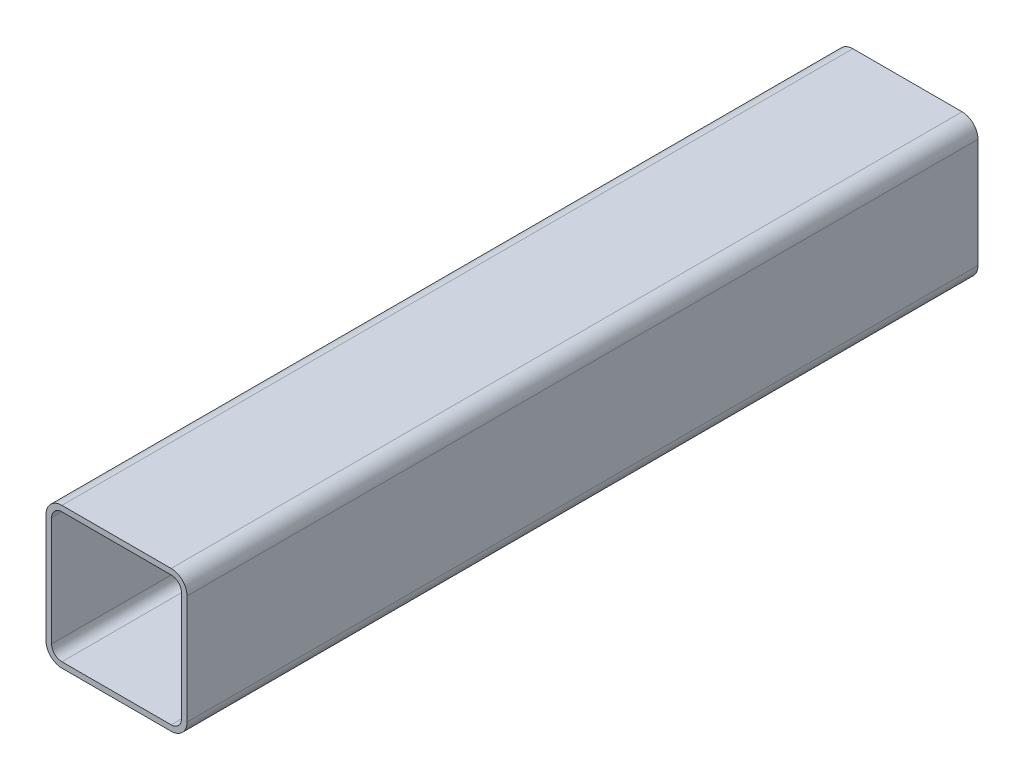
ISO-10303-21;
HEADER;
FILE_DESCRIPTION(('STEP AP214'),'2;1');
FILE_NAME('part.step','',(''),(''),'','','');
FILE_SCHEMA(('AUTOMOTIVE_DESIGN { 1 0 10303 214 1 1 1 1 }'));
ENDSEC;
DATA;
#1=APPLICATION_CONTEXT('core data for automotive mechanical design processes');
#2=APPLICATION_PROTOCOL_DEFINITION('international standard','automotive_design',2000,#1);
#3=PRODUCT_CONTEXT('',#1,'mechanical');
#4=PRODUCT('Part','Part','',(#3));
#5=PRODUCT_RELATED_PRODUCT_CATEGORY('part','',(#4));
#6=PRODUCT_DEFINITION_FORMATION('','',#4);
#7=PRODUCT_DEFINITION_CONTEXT('part definition',#1,'design');
#8=PRODUCT_DEFINITION('design','',#6,#7);
#9=PRODUCT_DEFINITION_SHAPE('','',#8);
#10=(LENGTH_UNIT() NAMED_UNIT(*) SI_UNIT(.MILLI.,.METRE.));
#11=(NAMED_UNIT(*) PLANE_ANGLE_UNIT() SI_UNIT($,.RADIAN.));
#12=(NAMED_UNIT(*) SI_UNIT($,.STERADIAN.) SOLID_ANGLE_UNIT());
#13=UNCERTAINTY_MEASURE_WITH_UNIT(LENGTH_MEASURE(1.E-05),#10,'distance_accuracy_value','');
#14=(GEOMETRIC_REPRESENTATION_CONTEXT(3) GLOBAL_UNCERTAINTY_ASSIGNED_CONTEXT((#13)) GLOBAL_UNIT_ASSIGNED_CONTEXT((#10,
#11,#12)) REPRESENTATION_CONTEXT('',''));
#15=CARTESIAN_POINT('',(0.,0.,0.));
#16=DIRECTION('',(0.,0.,1.));
#17=DIRECTION('',(1.,0.,0.));
#18=AXIS2_PLACEMENT_3D('',#15,#16,#17);
#19=CARTESIAN_POINT('',(-27.178,-27.178,-152.4));
#20=DIRECTION('',(0.,0.,1.));
#21=DIRECTION('',(1.,0.,0.));
#22=AXIS2_PLACEMENT_3D('',#19,#20,#21);
#23=PLANE('',#22);
#24=DIRECTION('',(0.,1.,0.));
#25=VECTOR('',#24,1.);
#26=CARTESIAN_POINT('',(-25.019,0.,-152.4));
#27=LINE('',#26,#25);
#28=CARTESIAN_POINT('',(-25.019,-21.0502500003569,-152.4));
#29=VERTEX_POINT('',#28);
#30=CARTESIAN_POINT('',(-25.019,21.0502499999995,-152.4));
#31=VERTEX_POINT('',#30);
#32=EDGE_CURVE('E157',#29,#31,#27,.T.);
#33=ORIENTED_EDGE('',*,*,#32,.F.);
#34=CARTESIAN_POINT('',(-21.05025,-21.0502500000011,-152.4));
#35=DIRECTION('',(0.,0.,-1.));
#36=DIRECTION('',(0.,1.,0.));
#37=AXIS2_PLACEMENT_3D('',#34,#35,#36);
#38=CIRCLE('',#37,3.96875);
#39=CARTESIAN_POINT('',(-21.0502499992366,-25.019,-152.4));
#40=VERTEX_POINT('',#39);
#41=EDGE_CURVE('E208',#40,#29,#38,.T.);
#42=ORIENTED_EDGE('',*,*,#41,.F.);
#43=DIRECTION('',(-1.,0.,0.));
#44=VECTOR('',#43,1.);
#45=CARTESIAN_POINT('',(0.,-25.019,-152.4));
#46=LINE('',#45,#44);
#47=CARTESIAN_POINT('',(21.05025,-25.019,-152.4));
#48=VERTEX_POINT('',#47);
#49=EDGE_CURVE('E153',#48,#40,#46,.T.);
#50=ORIENTED_EDGE('',*,*,#49,.F.);
#51=CARTESIAN_POINT('',(21.05025,-21.0502500000011,-152.4));
#52=DIRECTION('',(0.,0.,-1.));
#53=DIRECTION('',(0.,1.,0.));
#54=AXIS2_PLACEMENT_3D('',#51,#52,#53);
#55=CIRCLE('',#54,3.96875);
#56=CARTESIAN_POINT('',(25.019,-21.0502500008145,-152.4));
#57=VERTEX_POINT('',#56);
#58=EDGE_CURVE('E212',#57,#48,#55,.T.);
#59=ORIENTED_EDGE('',*,*,#58,.F.);
#60=DIRECTION('',(0.,-1.,0.));
#61=VECTOR('',#60,1.);
#62=CARTESIAN_POINT('',(25.019,0.,-152.4));
#63=LINE('',#62,#61);
#64=CARTESIAN_POINT('',(25.019,21.0502499999995,-152.4));
#65=VERTEX_POINT('',#64);
#66=EDGE_CURVE('E162',#65,#57,#63,.T.);
#67=ORIENTED_EDGE('',*,*,#66,.F.);
#68=CARTESIAN_POINT('',(21.05025,21.0502499999989,-152.4));
#69=DIRECTION('',(0.,0.,-1.));
#70=DIRECTION('',(0.,1.,0.));
#71=AXIS2_PLACEMENT_3D('',#68,#69,#70);
#72=CIRCLE('',#71,3.96875);
#73=CARTESIAN_POINT('',(21.050250000407,25.019,-152.4));
#74=VERTEX_POINT('',#73);
#75=EDGE_CURVE('E215',#74,#65,#72,.T.);
#76=ORIENTED_EDGE('',*,*,#75,.F.);
#77=DIRECTION('',(1.,0.,0.));
#78=VECTOR('',#77,1.);
#79=CARTESIAN_POINT('',(0.,25.019,-152.4));
#80=LINE('',#79,#78);
#81=CARTESIAN_POINT('',(-21.05025,25.019,-152.4));
#82=VERTEX_POINT('',#81);
#83=EDGE_CURVE('E167',#82,#74,#80,.T.);
#84=ORIENTED_EDGE('',*,*,#83,.F.);
#85=CARTESIAN_POINT('',(-21.05025,21.0502499999989,-152.4));
#86=DIRECTION('',(0.,0.,-1.));
#87=DIRECTION('',(0.,1.,0.));
#88=AXIS2_PLACEMENT_3D('',#85,#86,#87);
#89=CIRCLE('',#88,3.96875);
#90=EDGE_CURVE('E160',#31,#82,#89,.T.);
#91=ORIENTED_EDGE('',*,*,#90,.F.);
#92=EDGE_LOOP('',(#33,#42,#50,#59,#67,#76,#84,#91));
#93=FACE_BOUND('',#92,.T.);
#94=DIRECTION('',(0.,-1.,0.));
#95=VECTOR('',#94,1.);
#96=CARTESIAN_POINT('',(27.178,0.,-152.4));
#97=LINE('',#96,#95);
#98=CARTESIAN_POINT('',(27.178,21.0502499999997,-152.4));
#99=VERTEX_POINT('',#98);
#100=CARTESIAN_POINT('',(27.178,-21.0502500000003,-152.4));
#101=VERTEX_POINT('',#100);
#102=EDGE_CURVE('E161',#99,#101,#97,.T.);
#103=ORIENTED_EDGE('',*,*,#102,.T.);
#104=CARTESIAN_POINT('',(21.05025,-21.0502500000007,-152.4));
#105=DIRECTION('',(0.,0.,-1.));
#106=DIRECTION('',(0.,1.,0.));
#107=AXIS2_PLACEMENT_3D('',#104,#105,#106);
#108=CIRCLE('',#107,6.12775);
#109=CARTESIAN_POINT('',(21.0502500011786,-27.178,-152.4));
#110=VERTEX_POINT('',#109);
#111=EDGE_CURVE('E220',#101,#110,#108,.T.);
#112=ORIENTED_EDGE('',*,*,#111,.T.);
#113=DIRECTION('',(-1.,0.,0.));
#114=VECTOR('',#113,1.);
#115=CARTESIAN_POINT('',(0.,-27.178,-152.4));
#116=LINE('',#115,#114);
#117=CARTESIAN_POINT('',(-21.05025,-27.178,-152.4));
#118=VERTEX_POINT('',#117);
#119=EDGE_CURVE('E173',#110,#118,#116,.T.);
#120=ORIENTED_EDGE('',*,*,#119,.T.);
#121=CARTESIAN_POINT('',(-21.05025,-21.0502500000007,-152.4));
#122=DIRECTION('',(0.,0.,-1.));
#123=DIRECTION('',(0.,1.,0.));
#124=AXIS2_PLACEMENT_3D('',#121,#122,#123);
#125=CIRCLE('',#124,6.12775);
#126=CARTESIAN_POINT('',(-27.178,-21.0502500005506,-152.4));
#127=VERTEX_POINT('',#126);
#128=EDGE_CURVE('E224',#118,#127,#125,.T.);
#129=ORIENTED_EDGE('',*,*,#128,.T.);
#130=DIRECTION('',(0.,1.,0.));
#131=VECTOR('',#130,1.);
#132=CARTESIAN_POINT('',(-27.178,0.,-152.4));
#133=LINE('',#132,#131);
#134=CARTESIAN_POINT('',(-27.178,21.0502499999997,-152.4));
#135=VERTEX_POINT('',#134);
#136=EDGE_CURVE('E178',#127,#135,#133,.T.);
#137=ORIENTED_EDGE('',*,*,#136,.T.);
#138=CARTESIAN_POINT('',(-21.05025,21.0502499999993,-152.4));
#139=DIRECTION('',(0.,0.,-1.));
#140=DIRECTION('',(0.,1.,0.));
#141=AXIS2_PLACEMENT_3D('',#138,#139,#140);
#142=CIRCLE('',#141,6.12775);
#143=CARTESIAN_POINT('',(-21.0502499993716,27.178,-152.4));
#144=VERTEX_POINT('',#143);
#145=EDGE_CURVE('E140',#135,#144,#142,.T.);
#146=ORIENTED_EDGE('',*,*,#145,.T.);
#147=DIRECTION('',(1.,0.,0.));
#148=VECTOR('',#147,1.);
#149=CARTESIAN_POINT('',(0.,27.178,-152.4));
#150=LINE('',#149,#148);
#151=CARTESIAN_POINT('',(21.05025,27.178,-152.4));
#152=VERTEX_POINT('',#151);
#153=EDGE_CURVE('E138',#144,#152,#150,.T.);
#154=ORIENTED_EDGE('',*,*,#153,.T.);
#155=CARTESIAN_POINT('',(21.05025,21.0502499999993,-152.4));
#156=DIRECTION('',(0.,0.,-1.));
#157=DIRECTION('',(0.,1.,0.));
#158=AXIS2_PLACEMENT_3D('',#155,#156,#157);
#159=CIRCLE('',#158,6.12775);
#160=EDGE_CURVE('E19',#152,#99,#159,.T.);
#161=ORIENTED_EDGE('',*,*,#160,.T.);
#162=EDGE_LOOP('',(#103,#112,#120,#129,#137,#146,#154,#161));
#163=FACE_BOUND('',#162,.T.);
#164=ADVANCED_FACE('F15',(#93,#163),#23,.F.);
#165=CARTESIAN_POINT('',(21.05025,21.05025,152.4));
#166=DIRECTION('',(0.,0.,-1.));
#167=DIRECTION('',(0.,1.,0.));
#168=AXIS2_PLACEMENT_3D('',#165,#166,#167);
#169=CYLINDRICAL_SURFACE('',#168,6.12775);
#170=DIRECTION('',(0.,0.,1.));
#171=VECTOR('',#170,1.);
#172=CARTESIAN_POINT('',(21.05025,27.178,0.));
#173=LINE('',#172,#171);
#174=CARTESIAN_POINT('',(21.05025,27.178,152.4));
#175=VERTEX_POINT('',#174);
#176=EDGE_CURVE('E130',#152,#175,#173,.T.);
#177=ORIENTED_EDGE('',*,*,#176,.T.);
#178=CARTESIAN_POINT('',(21.05025,21.05025,152.4));
#179=DIRECTION('',(0.,0.,-1.));
#180=DIRECTION('',(0.,1.,0.));
#181=AXIS2_PLACEMENT_3D('',#178,#179,#180);
#182=CIRCLE('',#181,6.12775);
#183=CARTESIAN_POINT('',(27.178,21.05025,152.4));
#184=VERTEX_POINT('',#183);
#185=EDGE_CURVE('E206',#184,#175,#182,.F.);
#186=ORIENTED_EDGE('',*,*,#185,.F.);
#187=DIRECTION('',(0.,0.,-1.));
#188=VECTOR('',#187,1.);
#189=CARTESIAN_POINT('',(27.178,21.05025,0.));
#190=LINE('',#189,#188);
#191=EDGE_CURVE('E133',#184,#99,#190,.T.);
#192=ORIENTED_EDGE('',*,*,#191,.T.);
#193=ORIENTED_EDGE('',*,*,#160,.F.);
#194=EDGE_LOOP('',(#177,#186,#192,#193));
#195=FACE_BOUND('',#194,.T.);
#196=ADVANCED_FACE('F128',(#195),#169,.T.);
#197=CARTESIAN_POINT('',(-21.05025,27.178,152.4));
#198=DIRECTION('',(0.,-1.,0.));
#199=DIRECTION('',(0.,0.,-1.));
#200=AXIS2_PLACEMENT_3D('',#197,#198,#199);
#201=PLANE('',#200);
#202=DIRECTION('',(0.,0.,-1.));
#203=VECTOR('',#202,1.);
#204=CARTESIAN_POINT('',(-21.0502499987432,27.178,0.));
#205=LINE('',#204,#203);
#206=CARTESIAN_POINT('',(-21.0502499993716,27.178,152.4));
#207=VERTEX_POINT('',#206);
#208=EDGE_CURVE('E143',#144,#207,#205,.F.);
#209=ORIENTED_EDGE('',*,*,#208,.T.);
#210=DIRECTION('',(-1.,0.,0.));
#211=VECTOR('',#210,1.);
#212=CARTESIAN_POINT('',(0.,27.178,152.4));
#213=LINE('',#212,#211);
#214=EDGE_CURVE('E147',#175,#207,#213,.T.);
#215=ORIENTED_EDGE('',*,*,#214,.F.);
#216=ORIENTED_EDGE('',*,*,#176,.F.);
#217=ORIENTED_EDGE('',*,*,#153,.F.);
#218=EDGE_LOOP('',(#209,#215,#216,#217));
#219=FACE_BOUND('',#218,.T.);
#220=ADVANCED_FACE('F145',(#219),#201,.F.);
#221=CARTESIAN_POINT('',(-21.05025,21.05025,152.4));
#222=DIRECTION('',(0.,0.,-1.));
#223=DIRECTION('',(0.,1.,0.));
#224=AXIS2_PLACEMENT_3D('',#221,#222,#223);
#225=CYLINDRICAL_SURFACE('',#224,6.12775);
#226=DIRECTION('',(0.,0.,1.));
#227=VECTOR('',#226,1.);
#228=CARTESIAN_POINT('',(-27.178,21.05025,0.));
#229=LINE('',#228,#227);
#230=CARTESIAN_POINT('',(-27.178,21.05025,152.4));
#231=VERTEX_POINT('',#230);
#232=EDGE_CURVE('E180',#135,#231,#229,.T.);
#233=ORIENTED_EDGE('',*,*,#232,.T.);
#234=CARTESIAN_POINT('',(-21.05025,21.05025,152.4));
#235=DIRECTION('',(0.,0.,-1.));
#236=DIRECTION('',(0.,1.,0.));
#237=AXIS2_PLACEMENT_3D('',#234,#235,#236);
#238=CIRCLE('',#237,6.12775);
#239=EDGE_CURVE('E203',#207,#231,#238,.F.);
#240=ORIENTED_EDGE('',*,*,#239,.F.);
#241=ORIENTED_EDGE('',*,*,#208,.F.);
#242=ORIENTED_EDGE('',*,*,#145,.F.);
#243=EDGE_LOOP('',(#233,#240,#241,#242));
#244=FACE_BOUND('',#243,.T.);
#245=ADVANCED_FACE('F228',(#244),#225,.T.);
#246=CARTESIAN_POINT('',(-27.178,-21.05025,152.4));
#247=DIRECTION('',(1.,0.,0.));
#248=DIRECTION('',(0.,0.,-1.));
#249=AXIS2_PLACEMENT_3D('',#246,#247,#248);
#250=PLANE('',#249);
#251=DIRECTION('',(0.,0.,-1.));
#252=VECTOR('',#251,1.);
#253=CARTESIAN_POINT('',(-27.178,-21.0502500011005,0.));
#254=LINE('',#253,#252);
#255=CARTESIAN_POINT('',(-27.178,-21.0502500005502,152.4));
#256=VERTEX_POINT('',#255);
#257=EDGE_CURVE('E179',#127,#256,#254,.F.);
#258=ORIENTED_EDGE('',*,*,#257,.T.);
#259=DIRECTION('',(0.,-1.,0.));
#260=VECTOR('',#259,1.);
#261=CARTESIAN_POINT('',(-27.178,0.,152.4));
#262=LINE('',#261,#260);
#263=EDGE_CURVE('E202',#231,#256,#262,.T.);
#264=ORIENTED_EDGE('',*,*,#263,.F.);
#265=ORIENTED_EDGE('',*,*,#232,.F.);
#266=ORIENTED_EDGE('',*,*,#136,.F.);
#267=EDGE_LOOP('',(#258,#264,#265,#266));
#268=FACE_BOUND('',#267,.T.);
#269=ADVANCED_FACE('F260',(#268),#250,.F.);
#270=CARTESIAN_POINT('',(-21.05025,-21.05025,152.4));
#271=DIRECTION('',(0.,0.,-1.));
#272=DIRECTION('',(0.,1.,0.));
#273=AXIS2_PLACEMENT_3D('',#270,#271,#272);
#274=CYLINDRICAL_SURFACE('',#273,6.12775);
#275=DIRECTION('',(0.,0.,1.));
#276=VECTOR('',#275,1.);
#277=CARTESIAN_POINT('',(-21.05025,-27.178,0.));
#278=LINE('',#277,#276);
#279=CARTESIAN_POINT('',(-21.05025,-27.178,152.4));
#280=VERTEX_POINT('',#279);
#281=EDGE_CURVE('E177',#118,#280,#278,.T.);
#282=ORIENTED_EDGE('',*,*,#281,.T.);
#283=CARTESIAN_POINT('',(-21.05025,-21.05025,152.4));
#284=DIRECTION('',(0.,0.,-1.));
#285=DIRECTION('',(0.,1.,0.));
#286=AXIS2_PLACEMENT_3D('',#283,#284,#285);
#287=CIRCLE('',#286,6.12775);
#288=EDGE_CURVE('E199',#256,#280,#287,.F.);
#289=ORIENTED_EDGE('',*,*,#288,.F.);
#290=ORIENTED_EDGE('',*,*,#257,.F.);
#291=ORIENTED_EDGE('',*,*,#128,.F.);
#292=EDGE_LOOP('',(#282,#289,#290,#291));
#293=FACE_BOUND('',#292,.T.);
#294=ADVANCED_FACE('F262',(#293),#274,.T.);
#295=CARTESIAN_POINT('',(-21.05025,-27.178,-152.4));
#296=DIRECTION('',(0.,1.,0.));
#297=DIRECTION('',(0.,0.,1.));
#298=AXIS2_PLACEMENT_3D('',#295,#296,#297);
#299=PLANE('',#298);
#300=DIRECTION('',(0.,0.,-1.));
#301=VECTOR('',#300,1.);
#302=CARTESIAN_POINT('',(21.0502500023573,-27.178,0.));
#303=LINE('',#302,#301);
#304=CARTESIAN_POINT('',(21.0502500011786,-27.178,152.4));
#305=VERTEX_POINT('',#304);
#306=EDGE_CURVE('E176',#110,#305,#303,.F.);
#307=ORIENTED_EDGE('',*,*,#306,.T.);
#308=DIRECTION('',(1.,0.,0.));
#309=VECTOR('',#308,1.);
#310=CARTESIAN_POINT('',(0.,-27.178,152.4));
#311=LINE('',#310,#309);
#312=EDGE_CURVE('E198',#280,#305,#311,.T.);
#313=ORIENTED_EDGE('',*,*,#312,.F.);
#314=ORIENTED_EDGE('',*,*,#281,.F.);
#315=ORIENTED_EDGE('',*,*,#119,.F.);
#316=EDGE_LOOP('',(#307,#313,#314,#315));
#317=FACE_BOUND('',#316,.T.);
#318=ADVANCED_FACE('F318',(#317),#299,.F.);
#319=CARTESIAN_POINT('',(21.05025,-21.05025,152.4));
#320=DIRECTION('',(0.,0.,-1.));
#321=DIRECTION('',(0.,1.,0.));
#322=AXIS2_PLACEMENT_3D('',#319,#320,#321);
#323=CYLINDRICAL_SURFACE('',#322,6.12775);
#324=DIRECTION('',(0.,0.,1.));
#325=VECTOR('',#324,1.);
#326=CARTESIAN_POINT('',(27.178,-21.05025,0.));
#327=LINE('',#326,#325);
#328=CARTESIAN_POINT('',(27.178,-21.05025,152.4));
#329=VERTEX_POINT('',#328);
#330=EDGE_CURVE('E223',#101,#329,#327,.T.);
#331=ORIENTED_EDGE('',*,*,#330,.T.);
#332=CARTESIAN_POINT('',(21.05025,-21.05025,152.4));
#333=DIRECTION('',(0.,0.,-1.));
#334=DIRECTION('',(0.,1.,0.));
#335=AXIS2_PLACEMENT_3D('',#332,#333,#334);
#336=CIRCLE('',#335,6.12775);
#337=EDGE_CURVE('E194',#305,#329,#336,.F.);
#338=ORIENTED_EDGE('',*,*,#337,.F.);
#339=ORIENTED_EDGE('',*,*,#306,.F.);
#340=ORIENTED_EDGE('',*,*,#111,.F.);
#341=EDGE_LOOP('',(#331,#338,#339,#340));
#342=FACE_BOUND('',#341,.T.);
#343=ADVANCED_FACE('F314',(#342),#323,.T.);
#344=CARTESIAN_POINT('',(27.178,-21.05025,-152.4));
#345=DIRECTION('',(-1.,0.,0.));
#346=DIRECTION('',(0.,0.,1.));
#347=AXIS2_PLACEMENT_3D('',#344,#345,#346);
#348=PLANE('',#347);
#349=ORIENTED_EDGE('',*,*,#191,.F.);
#350=DIRECTION('',(0.,1.,0.));
#351=VECTOR('',#350,1.);
#352=CARTESIAN_POINT('',(27.178,0.,152.4));
#353=LINE('',#352,#351);
#354=EDGE_CURVE('E197',#329,#184,#353,.T.);
#355=ORIENTED_EDGE('',*,*,#354,.F.);
#356=ORIENTED_EDGE('',*,*,#330,.F.);
#357=ORIENTED_EDGE('',*,*,#102,.F.);
#358=EDGE_LOOP('',(#349,#355,#356,#357));
#359=FACE_BOUND('',#358,.T.);
#360=ADVANCED_FACE('F317',(#359),#348,.F.);
#361=CARTESIAN_POINT('',(-25.019,-21.05025,152.4));
#362=DIRECTION('',(1.,0.,0.));
#363=DIRECTION('',(0.,0.,-1.));
#364=AXIS2_PLACEMENT_3D('',#361,#362,#363);
#365=PLANE('',#364);
#366=DIRECTION('',(0.,1.,0.));
#367=VECTOR('',#366,1.);
#368=CARTESIAN_POINT('',(-25.019000009144,0.,152.4));
#369=LINE('',#368,#367);
#370=CARTESIAN_POINT('',(-25.019000004572,-21.0502500003564,152.4));
#371=VERTEX_POINT('',#370);
#372=CARTESIAN_POINT('',(-25.019000004572,21.05025,152.4));
#373=VERTEX_POINT('',#372);
#374=EDGE_CURVE('E193',#371,#373,#369,.T.);
#375=ORIENTED_EDGE('',*,*,#374,.F.);
#376=DIRECTION('',(0.,0.,-1.));
#377=VECTOR('',#376,1.);
#378=CARTESIAN_POINT('',(-25.019,-21.0502500007127,0.));
#379=LINE('',#378,#377);
#380=EDGE_CURVE('E211',#29,#371,#379,.F.);
#381=ORIENTED_EDGE('',*,*,#380,.F.);
#382=ORIENTED_EDGE('',*,*,#32,.T.);
#383=DIRECTION('',(0.,0.,1.));
#384=VECTOR('',#383,1.);
#385=CARTESIAN_POINT('',(-25.019,21.05025,0.));
#386=LINE('',#385,#384);
#387=EDGE_CURVE('E171',#373,#31,#386,.F.);
#388=ORIENTED_EDGE('',*,*,#387,.F.);
#389=EDGE_LOOP('',(#375,#381,#382,#388));
#390=FACE_BOUND('',#389,.T.);
#391=ADVANCED_FACE('F297',(#390),#365,.T.);
#392=CARTESIAN_POINT('',(-21.05025,21.05025,152.4));
#393=DIRECTION('',(0.,0.,-1.));
#394=DIRECTION('',(0.,1.,0.));
#395=AXIS2_PLACEMENT_3D('',#392,#393,#394);
#396=CYLINDRICAL_SURFACE('',#395,3.96875);
#397=CARTESIAN_POINT('',(-21.05025,21.05025,152.4));
#398=DIRECTION('',(0.,0.,-1.));
#399=DIRECTION('',(0.,1.,0.));
#400=AXIS2_PLACEMENT_3D('',#397,#398,#399);
#401=CIRCLE('',#400,3.96875);
#402=CARTESIAN_POINT('',(-21.05025,25.019000004572,152.4));
#403=VERTEX_POINT('',#402);
#404=EDGE_CURVE('E190',#373,#403,#401,.T.);
#405=ORIENTED_EDGE('',*,*,#404,.F.);
#406=ORIENTED_EDGE('',*,*,#387,.T.);
#407=ORIENTED_EDGE('',*,*,#90,.T.);
#408=DIRECTION('',(0.,0.,-1.));
#409=VECTOR('',#408,1.);
#410=CARTESIAN_POINT('',(-21.05025,25.019,0.));
#411=LINE('',#410,#409);
#412=EDGE_CURVE('E170',#403,#82,#411,.T.);
#413=ORIENTED_EDGE('',*,*,#412,.F.);
#414=EDGE_LOOP('',(#405,#406,#407,#413));
#415=FACE_BOUND('',#414,.T.);
#416=ADVANCED_FACE('F294',(#415),#396,.F.);
#417=CARTESIAN_POINT('',(-21.05025,25.019,152.4));
#418=DIRECTION('',(0.,-1.,0.));
#419=DIRECTION('',(0.,0.,-1.));
#420=AXIS2_PLACEMENT_3D('',#417,#418,#419);
#421=PLANE('',#420);
#422=DIRECTION('',(1.,0.,0.));
#423=VECTOR('',#422,1.);
#424=CARTESIAN_POINT('',(0.,25.019000009144,152.4));
#425=LINE('',#424,#423);
#426=CARTESIAN_POINT('',(21.050250000407,25.019000004572,152.4));
#427=VERTEX_POINT('',#426);
#428=EDGE_CURVE('E189',#403,#427,#425,.T.);
#429=ORIENTED_EDGE('',*,*,#428,.F.);
#430=ORIENTED_EDGE('',*,*,#412,.T.);
#431=ORIENTED_EDGE('',*,*,#83,.T.);
#432=DIRECTION('',(0.,0.,1.));
#433=VECTOR('',#432,1.);
#434=CARTESIAN_POINT('',(21.050250000814,25.019,0.));
#435=LINE('',#434,#433);
#436=EDGE_CURVE('E166',#427,#74,#435,.F.);
#437=ORIENTED_EDGE('',*,*,#436,.F.);
#438=EDGE_LOOP('',(#429,#430,#431,#437));
#439=FACE_BOUND('',#438,.T.);
#440=ADVANCED_FACE('F291',(#439),#421,.T.);
#441=CARTESIAN_POINT('',(21.05025,21.05025,152.4));
#442=DIRECTION('',(0.,0.,-1.));
#443=DIRECTION('',(0.,1.,0.));
#444=AXIS2_PLACEMENT_3D('',#441,#442,#443);
#445=CYLINDRICAL_SURFACE('',#444,3.96875);
#446=CARTESIAN_POINT('',(21.05025,21.05025,152.4));
#447=DIRECTION('',(0.,0.,-1.));
#448=DIRECTION('',(0.,1.,0.));
#449=AXIS2_PLACEMENT_3D('',#446,#447,#448);
#450=CIRCLE('',#449,3.96875);
#451=CARTESIAN_POINT('',(25.019000004572,21.05025,152.4));
#452=VERTEX_POINT('',#451);
#453=EDGE_CURVE('E186',#427,#452,#450,.T.);
#454=ORIENTED_EDGE('',*,*,#453,.F.);
#455=ORIENTED_EDGE('',*,*,#436,.T.);
#456=ORIENTED_EDGE('',*,*,#75,.T.);
#457=DIRECTION('',(0.,0.,-1.));
#458=VECTOR('',#457,1.);
#459=CARTESIAN_POINT('',(25.019,21.05025,0.));
#460=LINE('',#459,#458);
#461=EDGE_CURVE('E165',#452,#65,#460,.T.);
#462=ORIENTED_EDGE('',*,*,#461,.F.);
#463=EDGE_LOOP('',(#454,#455,#456,#462));
#464=FACE_BOUND('',#463,.T.);
#465=ADVANCED_FACE('F288',(#464),#445,.F.);
#466=CARTESIAN_POINT('',(25.019,-21.05025,-152.4));
#467=DIRECTION('',(-1.,0.,0.));
#468=DIRECTION('',(0.,0.,1.));
#469=AXIS2_PLACEMENT_3D('',#466,#467,#468);
#470=PLANE('',#469);
#471=DIRECTION('',(0.,-1.,0.));
#472=VECTOR('',#471,1.);
#473=CARTESIAN_POINT('',(25.019000009144,0.,152.4));
#474=LINE('',#473,#472);
#475=CARTESIAN_POINT('',(25.019000004572,-21.050250000814,152.4));
#476=VERTEX_POINT('',#475);
#477=EDGE_CURVE('E185',#452,#476,#474,.T.);
#478=ORIENTED_EDGE('',*,*,#477,.F.);
#479=ORIENTED_EDGE('',*,*,#461,.T.);
#480=ORIENTED_EDGE('',*,*,#66,.T.);
#481=DIRECTION('',(0.,0.,1.));
#482=VECTOR('',#481,1.);
#483=CARTESIAN_POINT('',(25.019,-21.050250001628,0.));
#484=LINE('',#483,#482);
#485=EDGE_CURVE('E156',#476,#57,#484,.F.);
#486=ORIENTED_EDGE('',*,*,#485,.F.);
#487=EDGE_LOOP('',(#478,#479,#480,#486));
#488=FACE_BOUND('',#487,.T.);
#489=ADVANCED_FACE('F285',(#488),#470,.T.);
#490=CARTESIAN_POINT('',(21.05025,-21.05025,152.4));
#491=DIRECTION('',(0.,0.,-1.));
#492=DIRECTION('',(0.,1.,0.));
#493=AXIS2_PLACEMENT_3D('',#490,#491,#492);
#494=CYLINDRICAL_SURFACE('',#493,3.96875);
#495=CARTESIAN_POINT('',(21.05025,-21.05025,152.4));
#496=DIRECTION('',(0.,0.,-1.));
#497=DIRECTION('',(0.,1.,0.));
#498=AXIS2_PLACEMENT_3D('',#495,#496,#497);
#499=CIRCLE('',#498,3.96875);
#500=CARTESIAN_POINT('',(21.05025,-25.019000004572,152.4));
#501=VERTEX_POINT('',#500);
#502=EDGE_CURVE('E182',#476,#501,#499,.T.);
#503=ORIENTED_EDGE('',*,*,#502,.F.);
#504=ORIENTED_EDGE('',*,*,#485,.T.);
#505=ORIENTED_EDGE('',*,*,#58,.T.);
#506=DIRECTION('',(0.,0.,-1.));
#507=VECTOR('',#506,1.);
#508=CARTESIAN_POINT('',(21.05025,-25.019,0.));
#509=LINE('',#508,#507);
#510=EDGE_CURVE('E155',#501,#48,#509,.T.);
#511=ORIENTED_EDGE('',*,*,#510,.F.);
#512=EDGE_LOOP('',(#503,#504,#505,#511));
#513=FACE_BOUND('',#512,.T.);
#514=ADVANCED_FACE('F281',(#513),#494,.F.);
#515=CARTESIAN_POINT('',(-21.05025,-25.019,-152.4));
#516=DIRECTION('',(0.,1.,0.));
#517=DIRECTION('',(0.,0.,1.));
#518=AXIS2_PLACEMENT_3D('',#515,#516,#517);
#519=PLANE('',#518);
#520=DIRECTION('',(-1.,0.,0.));
#521=VECTOR('',#520,1.);
#522=CARTESIAN_POINT('',(0.,-25.019000009144,152.4));
#523=LINE('',#522,#521);
#524=CARTESIAN_POINT('',(-21.0502499992366,-25.019000004572,152.4));
#525=VERTEX_POINT('',#524);
#526=EDGE_CURVE('E25',#501,#525,#523,.T.);
#527=ORIENTED_EDGE('',*,*,#526,.F.);
#528=ORIENTED_EDGE('',*,*,#510,.T.);
#529=ORIENTED_EDGE('',*,*,#49,.T.);
#530=DIRECTION('',(0.,0.,1.));
#531=VECTOR('',#530,1.);
#532=CARTESIAN_POINT('',(-21.0502499984733,-25.019,0.));
#533=LINE('',#532,#531);
#534=EDGE_CURVE('E34',#525,#40,#533,.F.);
#535=ORIENTED_EDGE('',*,*,#534,.F.);
#536=EDGE_LOOP('',(#527,#528,#529,#535));
#537=FACE_BOUND('',#536,.T.);
#538=ADVANCED_FACE('F279',(#537),#519,.T.);
#539=CARTESIAN_POINT('',(-21.05025,-21.05025,152.4));
#540=DIRECTION('',(0.,0.,-1.));
#541=DIRECTION('',(0.,1.,0.));
#542=AXIS2_PLACEMENT_3D('',#539,#540,#541);
#543=CYLINDRICAL_SURFACE('',#542,3.96875);
#544=CARTESIAN_POINT('',(-21.05025,-21.05025,152.4));
#545=DIRECTION('',(0.,0.,-1.));
#546=DIRECTION('',(0.,1.,0.));
#547=AXIS2_PLACEMENT_3D('',#544,#545,#546);
#548=CIRCLE('',#547,3.96875);
#549=EDGE_CURVE('E9',#525,#371,#548,.T.);
#550=ORIENTED_EDGE('',*,*,#549,.F.);
#551=ORIENTED_EDGE('',*,*,#534,.T.);
#552=ORIENTED_EDGE('',*,*,#41,.T.);
#553=ORIENTED_EDGE('',*,*,#380,.T.);
#554=EDGE_LOOP('',(#550,#551,#552,#553));
#555=FACE_BOUND('',#554,.T.);
#556=ADVANCED_FACE('F299',(#555),#543,.F.);
#557=CARTESIAN_POINT('',(-27.178,-27.178,152.4));
#558=DIRECTION('',(0.,0.,1.));
#559=DIRECTION('',(1.,0.,0.));
#560=AXIS2_PLACEMENT_3D('',#557,#558,#559);
#561=PLANE('',#560);
#562=ORIENTED_EDGE('',*,*,#526,.T.);
#563=ORIENTED_EDGE('',*,*,#549,.T.);
#564=ORIENTED_EDGE('',*,*,#374,.T.);
#565=ORIENTED_EDGE('',*,*,#404,.T.);
#566=ORIENTED_EDGE('',*,*,#428,.T.);
#567=ORIENTED_EDGE('',*,*,#453,.T.);
#568=ORIENTED_EDGE('',*,*,#477,.T.);
#569=ORIENTED_EDGE('',*,*,#502,.T.);
#570=EDGE_LOOP('',(#562,#563,#564,#565,#566,#567,#568,#569));
#571=FACE_BOUND('',#570,.T.);
#572=ORIENTED_EDGE('',*,*,#337,.T.);
#573=ORIENTED_EDGE('',*,*,#354,.T.);
#574=ORIENTED_EDGE('',*,*,#185,.T.);
#575=ORIENTED_EDGE('',*,*,#214,.T.);
#576=ORIENTED_EDGE('',*,*,#239,.T.);
#577=ORIENTED_EDGE('',*,*,#263,.T.);
#578=ORIENTED_EDGE('',*,*,#288,.T.);
#579=ORIENTED_EDGE('',*,*,#312,.T.);
#580=EDGE_LOOP('',(#572,#573,#574,#575,#576,#577,#578,#579));
#581=FACE_BOUND('',#580,.T.);
#582=ADVANCED_FACE('F17',(#571,#581),#561,.T.);
#583=CLOSED_SHELL('',(#164,#196,#220,#245,#269,#294,#318,#343,#360,#391,#416,#440,#465,#489,
#514,#538,#556,#582));
#584=MANIFOLD_SOLID_BREP('B1',#583);
#585=ADVANCED_BREP_SHAPE_REPRESENTATION('',(#18,#584),#14);
#586=SHAPE_DEFINITION_REPRESENTATION(#9,#585);
ENDSEC;
END-ISO-10303-21;
